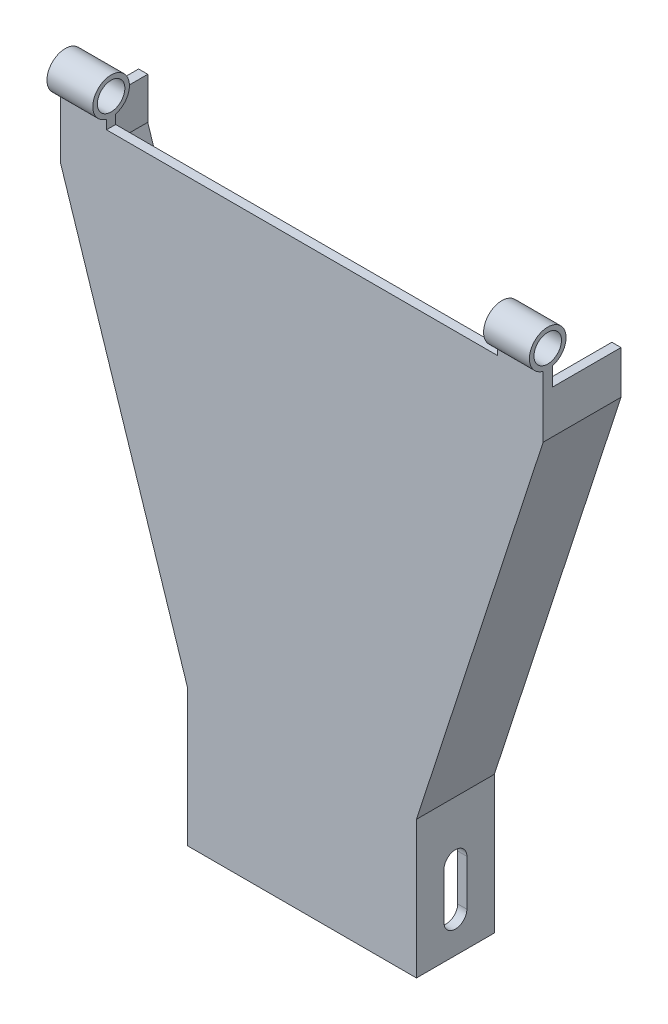
ISO-10303-21;
HEADER;
FILE_DESCRIPTION(('STEP AP214'),'2;1');
FILE_NAME('part.step','',(''),(''),'','','');
FILE_SCHEMA(('AUTOMOTIVE_DESIGN { 1 0 10303 214 1 1 1 1 }'));
ENDSEC;
DATA;
#1=APPLICATION_CONTEXT('core data for automotive mechanical design processes');
#2=APPLICATION_PROTOCOL_DEFINITION('international standard','automotive_design',2000,#1);
#3=PRODUCT_CONTEXT('',#1,'mechanical');
#4=PRODUCT('Part','Part','',(#3));
#5=PRODUCT_RELATED_PRODUCT_CATEGORY('part','',(#4));
#6=PRODUCT_DEFINITION_FORMATION('','',#4);
#7=PRODUCT_DEFINITION_CONTEXT('part definition',#1,'design');
#8=PRODUCT_DEFINITION('design','',#6,#7);
#9=PRODUCT_DEFINITION_SHAPE('','',#8);
#10=(LENGTH_UNIT() NAMED_UNIT(*) SI_UNIT(.MILLI.,.METRE.));
#11=(NAMED_UNIT(*) PLANE_ANGLE_UNIT() SI_UNIT($,.RADIAN.));
#12=(NAMED_UNIT(*) SI_UNIT($,.STERADIAN.) SOLID_ANGLE_UNIT());
#13=UNCERTAINTY_MEASURE_WITH_UNIT(LENGTH_MEASURE(1.E-05),#10,'distance_accuracy_value','');
#14=(GEOMETRIC_REPRESENTATION_CONTEXT(3) GLOBAL_UNCERTAINTY_ASSIGNED_CONTEXT((#13)) GLOBAL_UNIT_ASSIGNED_CONTEXT((#10,
#11,#12)) REPRESENTATION_CONTEXT('',''));
#15=CARTESIAN_POINT('',(0.,0.,0.));
#16=DIRECTION('',(0.,0.,1.));
#17=DIRECTION('',(1.,0.,0.));
#18=AXIS2_PLACEMENT_3D('',#15,#16,#17);
#19=CARTESIAN_POINT('',(-25.,-115.5,5.));
#20=DIRECTION('',(1.,0.,0.));
#21=DIRECTION('',(0.,1.,0.));
#22=AXIS2_PLACEMENT_3D('',#19,#20,#21);
#23=PLANE('',#22);
#24=DIRECTION('',(0.,0.,-1.));
#25=VECTOR('',#24,1.);
#26=CARTESIAN_POINT('',(-25.,-115.5,5.));
#27=LINE('',#26,#25);
#28=CARTESIAN_POINT('',(-25.,-115.5,5.));
#29=VERTEX_POINT('',#28);
#30=CARTESIAN_POINT('',(-25.,-115.5,-12.));
#31=VERTEX_POINT('',#30);
#32=EDGE_CURVE('E451',#29,#31,#27,.T.);
#33=ORIENTED_EDGE('',*,*,#32,.T.);
#34=DIRECTION('',(0.,-1.,0.));
#35=VECTOR('',#34,1.);
#36=CARTESIAN_POINT('',(-25.,-145.5,-12.));
#37=LINE('',#36,#35);
#38=CARTESIAN_POINT('',(-25.,-145.5,-12.));
#39=VERTEX_POINT('',#38);
#40=EDGE_CURVE('E261',#31,#39,#37,.T.);
#41=ORIENTED_EDGE('',*,*,#40,.T.);
#42=DIRECTION('',(0.,0.,-1.));
#43=VECTOR('',#42,1.);
#44=CARTESIAN_POINT('',(-25.,-145.5,5.));
#45=LINE('',#44,#43);
#46=CARTESIAN_POINT('',(-25.,-145.5,5.));
#47=VERTEX_POINT('',#46);
#48=EDGE_CURVE('E449',#47,#39,#45,.T.);
#49=ORIENTED_EDGE('',*,*,#48,.F.);
#50=DIRECTION('',(0.,-1.,0.));
#51=VECTOR('',#50,1.);
#52=CARTESIAN_POINT('',(-25.,-115.5,5.));
#53=LINE('',#52,#51);
#54=EDGE_CURVE('E401',#29,#47,#53,.T.);
#55=ORIENTED_EDGE('',*,*,#54,.F.);
#56=EDGE_LOOP('',(#33,#41,#49,#55));
#57=FACE_BOUND('',#56,.T.);
#58=CARTESIAN_POINT('',(-25.,-128.,-3.5));
#59=DIRECTION('',(1.,0.,0.));
#60=DIRECTION('',(0.,1.,0.));
#61=AXIS2_PLACEMENT_3D('',#58,#59,#60);
#62=CIRCLE('',#61,2.5);
#63=CARTESIAN_POINT('',(-25.,-128.,-6.));
#64=VERTEX_POINT('',#63);
#65=CARTESIAN_POINT('',(-25.,-128.,-1.));
#66=VERTEX_POINT('',#65);
#67=EDGE_CURVE('E52',#64,#66,#62,.T.);
#68=ORIENTED_EDGE('',*,*,#67,.T.);
#69=DIRECTION('',(0.,-1.,0.));
#70=VECTOR('',#69,1.);
#71=CARTESIAN_POINT('',(-25.,-128.,-1.));
#72=LINE('',#71,#70);
#73=CARTESIAN_POINT('',(-25.,-138.,-1.));
#74=VERTEX_POINT('',#73);
#75=EDGE_CURVE('E251',#66,#74,#72,.T.);
#76=ORIENTED_EDGE('',*,*,#75,.T.);
#77=CARTESIAN_POINT('',(-25.,-138.,-3.5));
#78=DIRECTION('',(1.,0.,0.));
#79=DIRECTION('',(0.,1.,0.));
#80=AXIS2_PLACEMENT_3D('',#77,#78,#79);
#81=CIRCLE('',#80,2.5);
#82=CARTESIAN_POINT('',(-25.,-138.,-6.));
#83=VERTEX_POINT('',#82);
#84=EDGE_CURVE('E237',#74,#83,#81,.T.);
#85=ORIENTED_EDGE('',*,*,#84,.T.);
#86=DIRECTION('',(0.,1.,0.));
#87=VECTOR('',#86,1.);
#88=CARTESIAN_POINT('',(-25.,-128.,-6.));
#89=LINE('',#88,#87);
#90=EDGE_CURVE('E246',#83,#64,#89,.T.);
#91=ORIENTED_EDGE('',*,*,#90,.T.);
#92=EDGE_LOOP('',(#68,#76,#85,#91));
#93=FACE_BOUND('',#92,.T.);
#94=ADVANCED_FACE('F37',(#57,#93),#23,.F.);
#95=CARTESIAN_POINT('',(-23.,-115.183238377329,-12.));
#96=DIRECTION('',(1.,0.,0.));
#97=DIRECTION('',(0.,1.,0.));
#98=AXIS2_PLACEMENT_3D('',#95,#96,#97);
#99=PLANE('',#98);
#100=DIRECTION('',(0.,1.,0.));
#101=VECTOR('',#100,1.);
#102=CARTESIAN_POINT('',(-23.,-115.183238377329,3.));
#103=LINE('',#102,#101);
#104=CARTESIAN_POINT('',(-23.,-145.5,3.));
#105=VERTEX_POINT('',#104);
#106=CARTESIAN_POINT('',(-23.,-115.183238377329,3.));
#107=VERTEX_POINT('',#106);
#108=EDGE_CURVE('E265',#105,#107,#103,.T.);
#109=ORIENTED_EDGE('',*,*,#108,.F.);
#110=DIRECTION('',(0.,0.,1.));
#111=VECTOR('',#110,1.);
#112=CARTESIAN_POINT('',(-23.,-145.5,-12.));
#113=LINE('',#112,#111);
#114=CARTESIAN_POINT('',(-23.,-145.5,-12.));
#115=VERTEX_POINT('',#114);
#116=EDGE_CURVE('E286',#115,#105,#113,.T.);
#117=ORIENTED_EDGE('',*,*,#116,.F.);
#118=DIRECTION('',(0.,1.,0.));
#119=VECTOR('',#118,1.);
#120=CARTESIAN_POINT('',(-23.,-115.183238377329,-12.));
#121=LINE('',#120,#119);
#122=CARTESIAN_POINT('',(-23.,-115.183238377329,-12.));
#123=VERTEX_POINT('',#122);
#124=EDGE_CURVE('E280',#115,#123,#121,.T.);
#125=ORIENTED_EDGE('',*,*,#124,.T.);
#126=DIRECTION('',(0.,0.,1.));
#127=VECTOR('',#126,1.);
#128=CARTESIAN_POINT('',(-23.,-115.183238377329,-12.));
#129=LINE('',#128,#127);
#130=EDGE_CURVE('E299',#123,#107,#129,.T.);
#131=ORIENTED_EDGE('',*,*,#130,.T.);
#132=EDGE_LOOP('',(#109,#117,#125,#131));
#133=FACE_BOUND('',#132,.T.);
#134=DIRECTION('',(0.,1.,0.));
#135=VECTOR('',#134,1.);
#136=CARTESIAN_POINT('',(-23.,-115.183238377329,-0.999999999999999));
#137=LINE('',#136,#135);
#138=CARTESIAN_POINT('',(-23.,-138.,-1.));
#139=VERTEX_POINT('',#138);
#140=CARTESIAN_POINT('',(-23.,-128.,-1.));
#141=VERTEX_POINT('',#140);
#142=EDGE_CURVE('E45',#139,#141,#137,.T.);
#143=ORIENTED_EDGE('',*,*,#142,.T.);
#144=CARTESIAN_POINT('',(-23.,-128.,-3.5));
#145=DIRECTION('',(1.,0.,0.));
#146=DIRECTION('',(0.,1.,0.));
#147=AXIS2_PLACEMENT_3D('',#144,#145,#146);
#148=CIRCLE('',#147,2.5);
#149=CARTESIAN_POINT('',(-23.,-128.,-6.));
#150=VERTEX_POINT('',#149);
#151=EDGE_CURVE('E11',#141,#150,#148,.F.);
#152=ORIENTED_EDGE('',*,*,#151,.T.);
#153=DIRECTION('',(0.,-1.,0.));
#154=VECTOR('',#153,1.);
#155=CARTESIAN_POINT('',(-23.,-115.183238377329,-6.));
#156=LINE('',#155,#154);
#157=CARTESIAN_POINT('',(-23.,-138.,-6.));
#158=VERTEX_POINT('',#157);
#159=EDGE_CURVE('E467',#150,#158,#156,.T.);
#160=ORIENTED_EDGE('',*,*,#159,.T.);
#161=CARTESIAN_POINT('',(-23.,-138.,-3.5));
#162=DIRECTION('',(1.,0.,0.));
#163=DIRECTION('',(0.,1.,0.));
#164=AXIS2_PLACEMENT_3D('',#161,#162,#163);
#165=CIRCLE('',#164,2.5);
#166=EDGE_CURVE('E240',#158,#139,#165,.F.);
#167=ORIENTED_EDGE('',*,*,#166,.T.);
#168=EDGE_LOOP('',(#143,#152,#160,#167));
#169=FACE_BOUND('',#168,.T.);
#170=ADVANCED_FACE('F471',(#133,#169),#99,.T.);
#171=CARTESIAN_POINT('',(0.,0.,3.));
#172=DIRECTION('',(0.,0.,-1.));
#173=DIRECTION('',(-1.,0.,0.));
#174=AXIS2_PLACEMENT_3D('',#171,#172,#173);
#175=PLANE('',#174);
#176=DIRECTION('',(-1.,0.,0.));
#177=VECTOR('',#176,1.);
#178=CARTESIAN_POINT('',(-52.65,-21.,3.));
#179=LINE('',#178,#177);
#180=CARTESIAN_POINT('',(-50.65,-21.,3.));
#181=VERTEX_POINT('',#180);
#182=CARTESIAN_POINT('',(-52.65,-21.,3.));
#183=VERTEX_POINT('',#182);
#184=EDGE_CURVE('E258',#181,#183,#179,.T.);
#185=ORIENTED_EDGE('',*,*,#184,.T.);
#186=DIRECTION('',(0.,-1.,0.));
#187=VECTOR('',#186,1.);
#188=CARTESIAN_POINT('',(-52.65,-30.4,3.));
#189=LINE('',#188,#187);
#190=CARTESIAN_POINT('',(-52.65,-17.,3.));
#191=VERTEX_POINT('',#190);
#192=EDGE_CURVE('E422',#191,#183,#189,.T.);
#193=ORIENTED_EDGE('',*,*,#192,.F.);
#194=DIRECTION('',(-1.,0.,0.));
#195=VECTOR('',#194,1.);
#196=CARTESIAN_POINT('',(-52.65,-17.,3.));
#197=LINE('',#196,#195);
#198=CARTESIAN_POINT('',(-42.65,-17.,3.));
#199=VERTEX_POINT('',#198);
#200=EDGE_CURVE('E390',#199,#191,#197,.T.);
#201=ORIENTED_EDGE('',*,*,#200,.F.);
#202=DIRECTION('',(0.,1.,0.));
#203=VECTOR('',#202,1.);
#204=CARTESIAN_POINT('',(-42.65,-17.,3.));
#205=LINE('',#204,#203);
#206=CARTESIAN_POINT('',(-42.65,-19.,3.));
#207=VERTEX_POINT('',#206);
#208=EDGE_CURVE('E397',#207,#199,#205,.T.);
#209=ORIENTED_EDGE('',*,*,#208,.F.);
#210=DIRECTION('',(-1.,0.,0.));
#211=VECTOR('',#210,1.);
#212=CARTESIAN_POINT('',(-42.65,-19.,3.));
#213=LINE('',#212,#211);
#214=CARTESIAN_POINT('',(42.65,-19.,3.));
#215=VERTEX_POINT('',#214);
#216=EDGE_CURVE('E434',#215,#207,#213,.T.);
#217=ORIENTED_EDGE('',*,*,#216,.F.);
#218=DIRECTION('',(0.,-1.,0.));
#219=VECTOR('',#218,1.);
#220=CARTESIAN_POINT('',(42.65,-19.,3.));
#221=LINE('',#220,#219);
#222=CARTESIAN_POINT('',(42.65,-17.,3.));
#223=VERTEX_POINT('',#222);
#224=EDGE_CURVE('E432',#223,#215,#221,.T.);
#225=ORIENTED_EDGE('',*,*,#224,.F.);
#226=DIRECTION('',(-1.,0.,0.));
#227=VECTOR('',#226,1.);
#228=CARTESIAN_POINT('',(42.65,-17.,3.));
#229=LINE('',#228,#227);
#230=CARTESIAN_POINT('',(52.65,-17.,3.));
#231=VERTEX_POINT('',#230);
#232=EDGE_CURVE('E429',#231,#223,#229,.T.);
#233=ORIENTED_EDGE('',*,*,#232,.F.);
#234=DIRECTION('',(0.,1.,0.));
#235=VECTOR('',#234,1.);
#236=CARTESIAN_POINT('',(52.65,-17.,3.));
#237=LINE('',#236,#235);
#238=CARTESIAN_POINT('',(52.65,-21.,3.));
#239=VERTEX_POINT('',#238);
#240=EDGE_CURVE('E427',#239,#231,#237,.T.);
#241=ORIENTED_EDGE('',*,*,#240,.F.);
#242=DIRECTION('',(1.,0.,0.));
#243=VECTOR('',#242,1.);
#244=CARTESIAN_POINT('',(52.65,-21.,3.));
#245=LINE('',#244,#243);
#246=CARTESIAN_POINT('',(50.65,-21.,3.));
#247=VERTEX_POINT('',#246);
#248=EDGE_CURVE('E343',#247,#239,#245,.T.);
#249=ORIENTED_EDGE('',*,*,#248,.F.);
#250=DIRECTION('',(0.,1.,0.));
#251=VECTOR('',#250,1.);
#252=CARTESIAN_POINT('',(50.65,-30.0832383773289,3.));
#253=LINE('',#252,#251);
#254=CARTESIAN_POINT('',(50.65,-30.0832383773289,3.));
#255=VERTEX_POINT('',#254);
#256=EDGE_CURVE('E363',#255,#247,#253,.T.);
#257=ORIENTED_EDGE('',*,*,#256,.F.);
#258=DIRECTION('',(0.309010260538414,0.951058704224919,0.));
#259=VECTOR('',#258,1.);
#260=CARTESIAN_POINT('',(50.65,-30.0832383773289,3.));
#261=LINE('',#260,#259);
#262=CARTESIAN_POINT('',(23.,-115.183238377329,3.));
#263=VERTEX_POINT('',#262);
#264=EDGE_CURVE('E361',#263,#255,#261,.T.);
#265=ORIENTED_EDGE('',*,*,#264,.F.);
#266=DIRECTION('',(0.,1.,0.));
#267=VECTOR('',#266,1.);
#268=CARTESIAN_POINT('',(23.,-115.183238377329,3.));
#269=LINE('',#268,#267);
#270=CARTESIAN_POINT('',(23.,-145.5,3.));
#271=VERTEX_POINT('',#270);
#272=EDGE_CURVE('E332',#271,#263,#269,.T.);
#273=ORIENTED_EDGE('',*,*,#272,.F.);
#274=DIRECTION('',(1.,0.,0.));
#275=VECTOR('',#274,1.);
#276=CARTESIAN_POINT('',(25.,-145.5,3.));
#277=LINE('',#276,#275);
#278=EDGE_CURVE('E425',#105,#271,#277,.T.);
#279=ORIENTED_EDGE('',*,*,#278,.F.);
#280=ORIENTED_EDGE('',*,*,#108,.T.);
#281=DIRECTION('',(-0.309010260538414,0.951058704224919,0.));
#282=VECTOR('',#281,1.);
#283=CARTESIAN_POINT('',(-50.65,-30.0832383773289,3.));
#284=LINE('',#283,#282);
#285=CARTESIAN_POINT('',(-50.65,-30.0832383773289,3.));
#286=VERTEX_POINT('',#285);
#287=EDGE_CURVE('E292',#107,#286,#284,.T.);
#288=ORIENTED_EDGE('',*,*,#287,.T.);
#289=DIRECTION('',(0.,1.,0.));
#290=VECTOR('',#289,1.);
#291=CARTESIAN_POINT('',(-50.65,-30.0832383773289,3.));
#292=LINE('',#291,#290);
#293=EDGE_CURVE('E289',#286,#181,#292,.T.);
#294=ORIENTED_EDGE('',*,*,#293,.T.);
#295=EDGE_LOOP('',(#185,#193,#201,#209,#217,#225,#233,#241,#249,#257,#265,#273,#279,#280,#288,#294));
#296=FACE_BOUND('',#295,.T.);
#297=ADVANCED_FACE('F494',(#296),#175,.T.);
#298=CARTESIAN_POINT('',(-52.65,-30.4,5.));
#299=DIRECTION('',(1.,0.,0.));
#300=DIRECTION('',(0.,0.,-1.));
#301=AXIS2_PLACEMENT_3D('',#298,#299,#300);
#302=PLANE('',#301);
#303=DIRECTION('',(0.,-1.,0.));
#304=VECTOR('',#303,1.);
#305=CARTESIAN_POINT('',(-52.65,-30.4,5.));
#306=LINE('',#305,#304);
#307=CARTESIAN_POINT('',(-52.65,-17.,5.));
#308=VERTEX_POINT('',#307);
#309=CARTESIAN_POINT('',(-52.65,-30.4,5.));
#310=VERTEX_POINT('',#309);
#311=EDGE_CURVE('E396',#308,#310,#306,.T.);
#312=ORIENTED_EDGE('',*,*,#311,.F.);
#313=CARTESIAN_POINT('',(-52.65,-13.1270166537926,4.));
#314=DIRECTION('',(1.,0.,0.));
#315=DIRECTION('',(0.,0.,-1.));
#316=AXIS2_PLACEMENT_3D('',#313,#314,#315);
#317=CIRCLE('',#316,4.);
#318=EDGE_CURVE('E311',#191,#308,#317,.T.);
#319=ORIENTED_EDGE('',*,*,#318,.F.);
#320=ORIENTED_EDGE('',*,*,#192,.T.);
#321=DIRECTION('',(0.,0.,1.));
#322=VECTOR('',#321,1.);
#323=CARTESIAN_POINT('',(-52.65,-21.,-12.));
#324=LINE('',#323,#322);
#325=CARTESIAN_POINT('',(-52.65,-21.,-12.));
#326=VERTEX_POINT('',#325);
#327=EDGE_CURVE('E305',#326,#183,#324,.T.);
#328=ORIENTED_EDGE('',*,*,#327,.F.);
#329=DIRECTION('',(0.,-1.,0.));
#330=VECTOR('',#329,1.);
#331=CARTESIAN_POINT('',(-52.65,-30.4,-12.));
#332=LINE('',#331,#330);
#333=CARTESIAN_POINT('',(-52.65,-30.4,-12.));
#334=VERTEX_POINT('',#333);
#335=EDGE_CURVE('E268',#326,#334,#332,.T.);
#336=ORIENTED_EDGE('',*,*,#335,.T.);
#337=DIRECTION('',(0.,0.,-1.));
#338=VECTOR('',#337,1.);
#339=CARTESIAN_POINT('',(-52.65,-30.4,5.));
#340=LINE('',#339,#338);
#341=EDGE_CURVE('E453',#310,#334,#340,.T.);
#342=ORIENTED_EDGE('',*,*,#341,.F.);
#343=EDGE_LOOP('',(#312,#319,#320,#328,#336,#342));
#344=FACE_BOUND('',#343,.T.);
#345=CARTESIAN_POINT('',(-52.65,-13.1270166537926,4.));
#346=DIRECTION('',(1.,0.,0.));
#347=DIRECTION('',(0.,0.,-1.));
#348=AXIS2_PLACEMENT_3D('',#345,#346,#347);
#349=CIRCLE('',#348,3.);
#350=CARTESIAN_POINT('',(-52.65,-13.1270166537926,0.999999999999999));
#351=VERTEX_POINT('',#350);
#352=EDGE_CURVE('E307',#351,#351,#349,.T.);
#353=ORIENTED_EDGE('',*,*,#352,.T.);
#354=EDGE_LOOP('',(#353));
#355=FACE_BOUND('',#354,.T.);
#356=ADVANCED_FACE('F39',(#344,#355),#302,.F.);
#357=CARTESIAN_POINT('',(-52.65,-30.4,5.));
#358=DIRECTION('',(0.951058704224919,0.309010260538414,0.));
#359=DIRECTION('',(-0.309010260538414,0.951058704224919,0.));
#360=AXIS2_PLACEMENT_3D('',#357,#358,#359);
#361=PLANE('',#360);
#362=ORIENTED_EDGE('',*,*,#341,.T.);
#363=DIRECTION('',(0.309010260538414,-0.951058704224919,0.));
#364=VECTOR('',#363,1.);
#365=CARTESIAN_POINT('',(-25.,-115.5,-12.));
#366=LINE('',#365,#364);
#367=EDGE_CURVE('E264',#334,#31,#366,.T.);
#368=ORIENTED_EDGE('',*,*,#367,.T.);
#369=ORIENTED_EDGE('',*,*,#32,.F.);
#370=DIRECTION('',(0.309010260538414,-0.951058704224919,0.));
#371=VECTOR('',#370,1.);
#372=CARTESIAN_POINT('',(-52.65,-30.4,5.));
#373=LINE('',#372,#371);
#374=EDGE_CURVE('E399',#310,#29,#373,.T.);
#375=ORIENTED_EDGE('',*,*,#374,.F.);
#376=EDGE_LOOP('',(#362,#368,#369,#375));
#377=FACE_BOUND('',#376,.T.);
#378=ADVANCED_FACE('F500',(#377),#361,.F.);
#379=CARTESIAN_POINT('',(25.,-145.5,5.));
#380=DIRECTION('',(0.,1.,0.));
#381=DIRECTION('',(0.,0.,1.));
#382=AXIS2_PLACEMENT_3D('',#379,#380,#381);
#383=PLANE('',#382);
#384=ORIENTED_EDGE('',*,*,#48,.T.);
#385=DIRECTION('',(1.,0.,0.));
#386=VECTOR('',#385,1.);
#387=CARTESIAN_POINT('',(-23.,-145.5,-12.));
#388=LINE('',#387,#386);
#389=EDGE_CURVE('E283',#39,#115,#388,.T.);
#390=ORIENTED_EDGE('',*,*,#389,.T.);
#391=ORIENTED_EDGE('',*,*,#116,.T.);
#392=ORIENTED_EDGE('',*,*,#278,.T.);
#393=DIRECTION('',(0.,0.,1.));
#394=VECTOR('',#393,1.);
#395=CARTESIAN_POINT('',(23.,-145.5,-12.));
#396=LINE('',#395,#394);
#397=CARTESIAN_POINT('',(23.,-145.5,-12.));
#398=VERTEX_POINT('',#397);
#399=EDGE_CURVE('E377',#398,#271,#396,.T.);
#400=ORIENTED_EDGE('',*,*,#399,.F.);
#401=DIRECTION('',(-1.,0.,0.));
#402=VECTOR('',#401,1.);
#403=CARTESIAN_POINT('',(23.,-145.5,-12.));
#404=LINE('',#403,#402);
#405=CARTESIAN_POINT('',(25.,-145.5,-12.));
#406=VERTEX_POINT('',#405);
#407=EDGE_CURVE('E342',#406,#398,#404,.T.);
#408=ORIENTED_EDGE('',*,*,#407,.F.);
#409=DIRECTION('',(0.,0.,-1.));
#410=VECTOR('',#409,1.);
#411=CARTESIAN_POINT('',(25.,-145.5,5.));
#412=LINE('',#411,#410);
#413=CARTESIAN_POINT('',(25.,-145.5,5.));
#414=VERTEX_POINT('',#413);
#415=EDGE_CURVE('E447',#414,#406,#412,.T.);
#416=ORIENTED_EDGE('',*,*,#415,.F.);
#417=DIRECTION('',(1.,0.,0.));
#418=VECTOR('',#417,1.);
#419=CARTESIAN_POINT('',(25.,-145.5,5.));
#420=LINE('',#419,#418);
#421=EDGE_CURVE('E403',#47,#414,#420,.T.);
#422=ORIENTED_EDGE('',*,*,#421,.F.);
#423=EDGE_LOOP('',(#384,#390,#391,#392,#400,#408,#416,#422));
#424=FACE_BOUND('',#423,.T.);
#425=ADVANCED_FACE('F498',(#424),#383,.F.);
#426=CARTESIAN_POINT('',(25.,-115.5,5.));
#427=DIRECTION('',(-1.,0.,0.));
#428=DIRECTION('',(0.,-1.,0.));
#429=AXIS2_PLACEMENT_3D('',#426,#427,#428);
#430=PLANE('',#429);
#431=DIRECTION('',(0.,-1.,0.));
#432=VECTOR('',#431,1.);
#433=CARTESIAN_POINT('',(25.,-128.,-1.));
#434=LINE('',#433,#432);
#435=CARTESIAN_POINT('',(25.,-128.,-1.));
#436=VERTEX_POINT('',#435);
#437=CARTESIAN_POINT('',(25.,-138.,-1.));
#438=VERTEX_POINT('',#437);
#439=EDGE_CURVE('E320',#436,#438,#434,.T.);
#440=ORIENTED_EDGE('',*,*,#439,.F.);
#441=CARTESIAN_POINT('',(25.,-128.,-3.5));
#442=DIRECTION('',(1.,0.,0.));
#443=DIRECTION('',(0.,1.,0.));
#444=AXIS2_PLACEMENT_3D('',#441,#442,#443);
#445=CIRCLE('',#444,2.5);
#446=CARTESIAN_POINT('',(25.,-128.,-6.));
#447=VERTEX_POINT('',#446);
#448=EDGE_CURVE('E317',#447,#436,#445,.T.);
#449=ORIENTED_EDGE('',*,*,#448,.F.);
#450=DIRECTION('',(0.,1.,0.));
#451=VECTOR('',#450,1.);
#452=CARTESIAN_POINT('',(25.,-128.,-6.));
#453=LINE('',#452,#451);
#454=CARTESIAN_POINT('',(25.,-138.,-6.));
#455=VERTEX_POINT('',#454);
#456=EDGE_CURVE('E326',#455,#447,#453,.T.);
#457=ORIENTED_EDGE('',*,*,#456,.F.);
#458=CARTESIAN_POINT('',(25.,-138.,-3.5));
#459=DIRECTION('',(1.,0.,0.));
#460=DIRECTION('',(0.,1.,0.));
#461=AXIS2_PLACEMENT_3D('',#458,#459,#460);
#462=CIRCLE('',#461,2.5);
#463=EDGE_CURVE('E323',#438,#455,#462,.T.);
#464=ORIENTED_EDGE('',*,*,#463,.F.);
#465=EDGE_LOOP('',(#440,#449,#457,#464));
#466=FACE_BOUND('',#465,.T.);
#467=ORIENTED_EDGE('',*,*,#415,.T.);
#468=DIRECTION('',(0.,-1.,0.));
#469=VECTOR('',#468,1.);
#470=CARTESIAN_POINT('',(25.,-145.5,-12.));
#471=LINE('',#470,#469);
#472=CARTESIAN_POINT('',(25.,-115.5,-12.));
#473=VERTEX_POINT('',#472);
#474=EDGE_CURVE('E339',#473,#406,#471,.T.);
#475=ORIENTED_EDGE('',*,*,#474,.F.);
#476=DIRECTION('',(0.,0.,-1.));
#477=VECTOR('',#476,1.);
#478=CARTESIAN_POINT('',(25.,-115.5,5.));
#479=LINE('',#478,#477);
#480=CARTESIAN_POINT('',(25.,-115.5,5.));
#481=VERTEX_POINT('',#480);
#482=EDGE_CURVE('E445',#481,#473,#479,.T.);
#483=ORIENTED_EDGE('',*,*,#482,.F.);
#484=DIRECTION('',(0.,1.,0.));
#485=VECTOR('',#484,1.);
#486=CARTESIAN_POINT('',(25.,-115.5,5.));
#487=LINE('',#486,#485);
#488=EDGE_CURVE('E405',#414,#481,#487,.T.);
#489=ORIENTED_EDGE('',*,*,#488,.F.);
#490=EDGE_LOOP('',(#467,#475,#483,#489));
#491=FACE_BOUND('',#490,.T.);
#492=ADVANCED_FACE('F507',(#466,#491),#430,.F.);
#493=CARTESIAN_POINT('',(52.65,-30.4,5.));
#494=DIRECTION('',(-0.951058704224919,0.309010260538414,0.));
#495=DIRECTION('',(-0.309010260538414,-0.951058704224919,0.));
#496=AXIS2_PLACEMENT_3D('',#493,#494,#495);
#497=PLANE('',#496);
#498=ORIENTED_EDGE('',*,*,#482,.T.);
#499=DIRECTION('',(-0.309010260538414,-0.951058704224919,0.));
#500=VECTOR('',#499,1.);
#501=CARTESIAN_POINT('',(25.,-115.5,-12.));
#502=LINE('',#501,#500);
#503=CARTESIAN_POINT('',(52.65,-30.4,-12.));
#504=VERTEX_POINT('',#503);
#505=EDGE_CURVE('E356',#504,#473,#502,.T.);
#506=ORIENTED_EDGE('',*,*,#505,.F.);
#507=DIRECTION('',(0.,0.,-1.));
#508=VECTOR('',#507,1.);
#509=CARTESIAN_POINT('',(52.65,-30.4,5.));
#510=LINE('',#509,#508);
#511=CARTESIAN_POINT('',(52.65,-30.4,5.));
#512=VERTEX_POINT('',#511);
#513=EDGE_CURVE('E443',#512,#504,#510,.T.);
#514=ORIENTED_EDGE('',*,*,#513,.F.);
#515=DIRECTION('',(0.309010260538414,0.951058704224919,0.));
#516=VECTOR('',#515,1.);
#517=CARTESIAN_POINT('',(52.65,-30.4,5.));
#518=LINE('',#517,#516);
#519=EDGE_CURVE('E407',#481,#512,#518,.T.);
#520=ORIENTED_EDGE('',*,*,#519,.F.);
#521=EDGE_LOOP('',(#498,#506,#514,#520));
#522=FACE_BOUND('',#521,.T.);
#523=ADVANCED_FACE('F603',(#522),#497,.F.);
#524=CARTESIAN_POINT('',(52.65,-17.,5.));
#525=DIRECTION('',(-1.,0.,0.));
#526=DIRECTION('',(0.,0.,1.));
#527=AXIS2_PLACEMENT_3D('',#524,#525,#526);
#528=PLANE('',#527);
#529=ORIENTED_EDGE('',*,*,#513,.T.);
#530=DIRECTION('',(0.,-1.,0.));
#531=VECTOR('',#530,1.);
#532=CARTESIAN_POINT('',(52.65,-30.4,-12.));
#533=LINE('',#532,#531);
#534=CARTESIAN_POINT('',(52.65,-21.,-12.));
#535=VERTEX_POINT('',#534);
#536=EDGE_CURVE('E353',#535,#504,#533,.T.);
#537=ORIENTED_EDGE('',*,*,#536,.F.);
#538=DIRECTION('',(0.,0.,1.));
#539=VECTOR('',#538,1.);
#540=CARTESIAN_POINT('',(52.65,-21.,-12.));
#541=LINE('',#540,#539);
#542=EDGE_CURVE('E359',#535,#239,#541,.T.);
#543=ORIENTED_EDGE('',*,*,#542,.T.);
#544=ORIENTED_EDGE('',*,*,#240,.T.);
#545=CARTESIAN_POINT('',(52.65,-13.1270166537926,4.));
#546=DIRECTION('',(1.,0.,0.));
#547=DIRECTION('',(0.,0.,-1.));
#548=AXIS2_PLACEMENT_3D('',#545,#546,#547);
#549=CIRCLE('',#548,4.);
#550=CARTESIAN_POINT('',(52.65,-17.,5.));
#551=VERTEX_POINT('',#550);
#552=EDGE_CURVE('E384',#231,#551,#549,.T.);
#553=ORIENTED_EDGE('',*,*,#552,.T.);
#554=DIRECTION('',(0.,1.,0.));
#555=VECTOR('',#554,1.);
#556=CARTESIAN_POINT('',(52.65,-17.,5.));
#557=LINE('',#556,#555);
#558=EDGE_CURVE('E409',#512,#551,#557,.T.);
#559=ORIENTED_EDGE('',*,*,#558,.F.);
#560=EDGE_LOOP('',(#529,#537,#543,#544,#553,#559));
#561=FACE_BOUND('',#560,.T.);
#562=CARTESIAN_POINT('',(52.65,-13.1270166537926,4.));
#563=DIRECTION('',(1.,0.,0.));
#564=DIRECTION('',(0.,0.,-1.));
#565=AXIS2_PLACEMENT_3D('',#562,#563,#564);
#566=CIRCLE('',#565,3.);
#567=CARTESIAN_POINT('',(52.65,-13.1270166537926,0.999999999999999));
#568=VERTEX_POINT('',#567);
#569=EDGE_CURVE('E380',#568,#568,#566,.T.);
#570=ORIENTED_EDGE('',*,*,#569,.F.);
#571=EDGE_LOOP('',(#570));
#572=FACE_BOUND('',#571,.T.);
#573=ADVANCED_FACE('F568',(#561,#572),#528,.F.);
#574=CARTESIAN_POINT('',(42.65,-19.,5.));
#575=DIRECTION('',(1.,0.,0.));
#576=DIRECTION('',(0.,0.,-1.));
#577=AXIS2_PLACEMENT_3D('',#574,#575,#576);
#578=PLANE('',#577);
#579=DIRECTION('',(0.,-1.,0.));
#580=VECTOR('',#579,1.);
#581=CARTESIAN_POINT('',(42.65,-19.,5.));
#582=LINE('',#581,#580);
#583=CARTESIAN_POINT('',(42.65,-17.,5.));
#584=VERTEX_POINT('',#583);
#585=CARTESIAN_POINT('',(42.65,-19.,5.));
#586=VERTEX_POINT('',#585);
#587=EDGE_CURVE('E413',#584,#586,#582,.T.);
#588=ORIENTED_EDGE('',*,*,#587,.F.);
#589=CARTESIAN_POINT('',(42.65,-13.1270166537926,4.));
#590=DIRECTION('',(1.,0.,0.));
#591=DIRECTION('',(0.,0.,-1.));
#592=AXIS2_PLACEMENT_3D('',#589,#590,#591);
#593=CIRCLE('',#592,4.);
#594=EDGE_CURVE('E387',#223,#584,#593,.T.);
#595=ORIENTED_EDGE('',*,*,#594,.F.);
#596=ORIENTED_EDGE('',*,*,#224,.T.);
#597=DIRECTION('',(0.,0.,-1.));
#598=VECTOR('',#597,1.);
#599=CARTESIAN_POINT('',(42.65,-19.,5.));
#600=LINE('',#599,#598);
#601=EDGE_CURVE('E440',#586,#215,#600,.T.);
#602=ORIENTED_EDGE('',*,*,#601,.F.);
#603=EDGE_LOOP('',(#588,#595,#596,#602));
#604=FACE_BOUND('',#603,.T.);
#605=CARTESIAN_POINT('',(42.65,-13.1270166537926,4.));
#606=DIRECTION('',(1.,0.,0.));
#607=DIRECTION('',(0.,0.,-1.));
#608=AXIS2_PLACEMENT_3D('',#605,#606,#607);
#609=CIRCLE('',#608,3.);
#610=CARTESIAN_POINT('',(42.65,-13.1270166537926,0.999999999999999));
#611=VERTEX_POINT('',#610);
#612=EDGE_CURVE('E381',#611,#611,#609,.T.);
#613=ORIENTED_EDGE('',*,*,#612,.T.);
#614=EDGE_LOOP('',(#613));
#615=FACE_BOUND('',#614,.T.);
#616=ADVANCED_FACE('F557',(#604,#615),#578,.F.);
#617=CARTESIAN_POINT('',(-42.65,-19.,5.));
#618=DIRECTION('',(0.,-1.,0.));
#619=DIRECTION('',(0.,0.,-1.));
#620=AXIS2_PLACEMENT_3D('',#617,#618,#619);
#621=PLANE('',#620);
#622=ORIENTED_EDGE('',*,*,#216,.T.);
#623=DIRECTION('',(0.,0.,-1.));
#624=VECTOR('',#623,1.);
#625=CARTESIAN_POINT('',(-42.65,-19.,5.));
#626=LINE('',#625,#624);
#627=CARTESIAN_POINT('',(-42.65,-19.,5.));
#628=VERTEX_POINT('',#627);
#629=EDGE_CURVE('E420',#628,#207,#626,.T.);
#630=ORIENTED_EDGE('',*,*,#629,.F.);
#631=DIRECTION('',(-1.,0.,0.));
#632=VECTOR('',#631,1.);
#633=CARTESIAN_POINT('',(-42.65,-19.,5.));
#634=LINE('',#633,#632);
#635=EDGE_CURVE('E415',#586,#628,#634,.T.);
#636=ORIENTED_EDGE('',*,*,#635,.F.);
#637=ORIENTED_EDGE('',*,*,#601,.T.);
#638=EDGE_LOOP('',(#622,#630,#636,#637));
#639=FACE_BOUND('',#638,.T.);
#640=ADVANCED_FACE('F553',(#639),#621,.F.);
#641=CARTESIAN_POINT('',(-42.65,-17.,5.));
#642=DIRECTION('',(-1.,0.,0.));
#643=DIRECTION('',(0.,0.,1.));
#644=AXIS2_PLACEMENT_3D('',#641,#642,#643);
#645=PLANE('',#644);
#646=ORIENTED_EDGE('',*,*,#208,.T.);
#647=CARTESIAN_POINT('',(-42.65,-13.1270166537926,4.));
#648=DIRECTION('',(1.,0.,0.));
#649=DIRECTION('',(0.,0.,-1.));
#650=AXIS2_PLACEMENT_3D('',#647,#648,#649);
#651=CIRCLE('',#650,4.);
#652=CARTESIAN_POINT('',(-42.65,-17.,5.));
#653=VERTEX_POINT('',#652);
#654=EDGE_CURVE('E314',#199,#653,#651,.T.);
#655=ORIENTED_EDGE('',*,*,#654,.T.);
#656=DIRECTION('',(0.,1.,0.));
#657=VECTOR('',#656,1.);
#658=CARTESIAN_POINT('',(-42.65,-17.,5.));
#659=LINE('',#658,#657);
#660=EDGE_CURVE('E417',#628,#653,#659,.T.);
#661=ORIENTED_EDGE('',*,*,#660,.F.);
#662=ORIENTED_EDGE('',*,*,#629,.T.);
#663=EDGE_LOOP('',(#646,#655,#661,#662));
#664=FACE_BOUND('',#663,.T.);
#665=CARTESIAN_POINT('',(-42.65,-13.1270166537926,4.));
#666=DIRECTION('',(1.,0.,0.));
#667=DIRECTION('',(0.,0.,-1.));
#668=AXIS2_PLACEMENT_3D('',#665,#666,#667);
#669=CIRCLE('',#668,3.);
#670=CARTESIAN_POINT('',(-42.65,-13.1270166537926,0.999999999999999));
#671=VERTEX_POINT('',#670);
#672=EDGE_CURVE('E308',#671,#671,#669,.T.);
#673=ORIENTED_EDGE('',*,*,#672,.F.);
#674=EDGE_LOOP('',(#673));
#675=FACE_BOUND('',#674,.T.);
#676=ADVANCED_FACE('F547',(#664,#675),#645,.F.);
#677=CARTESIAN_POINT('',(0.,0.,5.));
#678=DIRECTION('',(0.,0.,-1.));
#679=DIRECTION('',(-1.,0.,0.));
#680=AXIS2_PLACEMENT_3D('',#677,#678,#679);
#681=PLANE('',#680);
#682=DIRECTION('',(-1.,0.,0.));
#683=VECTOR('',#682,1.);
#684=CARTESIAN_POINT('',(-52.65,-17.,5.));
#685=LINE('',#684,#683);
#686=EDGE_CURVE('E393',#653,#308,#685,.T.);
#687=ORIENTED_EDGE('',*,*,#686,.T.);
#688=ORIENTED_EDGE('',*,*,#311,.T.);
#689=ORIENTED_EDGE('',*,*,#374,.T.);
#690=ORIENTED_EDGE('',*,*,#54,.T.);
#691=ORIENTED_EDGE('',*,*,#421,.T.);
#692=ORIENTED_EDGE('',*,*,#488,.T.);
#693=ORIENTED_EDGE('',*,*,#519,.T.);
#694=ORIENTED_EDGE('',*,*,#558,.T.);
#695=DIRECTION('',(-1.,0.,0.));
#696=VECTOR('',#695,1.);
#697=CARTESIAN_POINT('',(42.65,-17.,5.));
#698=LINE('',#697,#696);
#699=EDGE_CURVE('E411',#551,#584,#698,.T.);
#700=ORIENTED_EDGE('',*,*,#699,.T.);
#701=ORIENTED_EDGE('',*,*,#587,.T.);
#702=ORIENTED_EDGE('',*,*,#635,.T.);
#703=ORIENTED_EDGE('',*,*,#660,.T.);
#704=EDGE_LOOP('',(#687,#688,#689,#690,#691,#692,#693,#694,#700,#701,#702,#703));
#705=FACE_BOUND('',#704,.T.);
#706=ADVANCED_FACE('F541',(#705),#681,.F.);
#707=CARTESIAN_POINT('',(42.65,-13.1270166537926,4.));
#708=DIRECTION('',(1.,0.,0.));
#709=DIRECTION('',(0.,0.,-1.));
#710=AXIS2_PLACEMENT_3D('',#707,#708,#709);
#711=CYLINDRICAL_SURFACE('',#710,4.);
#712=ORIENTED_EDGE('',*,*,#699,.F.);
#713=ORIENTED_EDGE('',*,*,#552,.F.);
#714=ORIENTED_EDGE('',*,*,#232,.T.);
#715=ORIENTED_EDGE('',*,*,#594,.T.);
#716=EDGE_LOOP('',(#712,#713,#714,#715));
#717=FACE_BOUND('',#716,.T.);
#718=ADVANCED_FACE('F565',(#717),#711,.T.);
#719=CARTESIAN_POINT('',(42.65,-13.1270166537926,4.));
#720=DIRECTION('',(1.,0.,0.));
#721=DIRECTION('',(0.,0.,-1.));
#722=AXIS2_PLACEMENT_3D('',#719,#720,#721);
#723=CYLINDRICAL_SURFACE('',#722,3.);
#724=ORIENTED_EDGE('',*,*,#612,.F.);
#725=EDGE_LOOP('',(#724));
#726=FACE_BOUND('',#725,.T.);
#727=ORIENTED_EDGE('',*,*,#569,.T.);
#728=EDGE_LOOP('',(#727));
#729=FACE_BOUND('',#728,.T.);
#730=ADVANCED_FACE('F625',(#726,#729),#723,.F.);
#731=CARTESIAN_POINT('',(23.,-115.183238377329,-12.));
#732=DIRECTION('',(1.,0.,0.));
#733=DIRECTION('',(0.,1.,0.));
#734=AXIS2_PLACEMENT_3D('',#731,#732,#733);
#735=PLANE('',#734);
#736=DIRECTION('',(0.,1.,0.));
#737=VECTOR('',#736,1.);
#738=CARTESIAN_POINT('',(23.,-115.183238377329,-6.));
#739=LINE('',#738,#737);
#740=CARTESIAN_POINT('',(23.,-138.,-6.));
#741=VERTEX_POINT('',#740);
#742=CARTESIAN_POINT('',(23.,-128.,-6.));
#743=VERTEX_POINT('',#742);
#744=EDGE_CURVE('E461',#741,#743,#739,.T.);
#745=ORIENTED_EDGE('',*,*,#744,.T.);
#746=CARTESIAN_POINT('',(23.,-128.,-3.5));
#747=DIRECTION('',(1.,0.,0.));
#748=DIRECTION('',(0.,1.,0.));
#749=AXIS2_PLACEMENT_3D('',#746,#747,#748);
#750=CIRCLE('',#749,2.5);
#751=CARTESIAN_POINT('',(23.,-128.,-1.));
#752=VERTEX_POINT('',#751);
#753=EDGE_CURVE('E464',#743,#752,#750,.T.);
#754=ORIENTED_EDGE('',*,*,#753,.T.);
#755=DIRECTION('',(0.,-1.,0.));
#756=VECTOR('',#755,1.);
#757=CARTESIAN_POINT('',(23.,-115.183238377329,-0.999999999999999));
#758=LINE('',#757,#756);
#759=CARTESIAN_POINT('',(23.,-138.,-1.));
#760=VERTEX_POINT('',#759);
#761=EDGE_CURVE('E455',#752,#760,#758,.T.);
#762=ORIENTED_EDGE('',*,*,#761,.T.);
#763=CARTESIAN_POINT('',(23.,-138.,-3.5));
#764=DIRECTION('',(1.,0.,0.));
#765=DIRECTION('',(0.,1.,0.));
#766=AXIS2_PLACEMENT_3D('',#763,#764,#765);
#767=CIRCLE('',#766,2.5);
#768=EDGE_CURVE('E458',#760,#741,#767,.T.);
#769=ORIENTED_EDGE('',*,*,#768,.T.);
#770=EDGE_LOOP('',(#745,#754,#762,#769));
#771=FACE_BOUND('',#770,.T.);
#772=ORIENTED_EDGE('',*,*,#272,.T.);
#773=DIRECTION('',(0.,0.,1.));
#774=VECTOR('',#773,1.);
#775=CARTESIAN_POINT('',(23.,-115.183238377329,-12.));
#776=LINE('',#775,#774);
#777=CARTESIAN_POINT('',(23.,-115.183238377329,-12.));
#778=VERTEX_POINT('',#777);
#779=EDGE_CURVE('E374',#778,#263,#776,.T.);
#780=ORIENTED_EDGE('',*,*,#779,.F.);
#781=DIRECTION('',(0.,1.,0.));
#782=VECTOR('',#781,1.);
#783=CARTESIAN_POINT('',(23.,-115.183238377329,-12.));
#784=LINE('',#783,#782);
#785=EDGE_CURVE('E345',#398,#778,#784,.T.);
#786=ORIENTED_EDGE('',*,*,#785,.F.);
#787=ORIENTED_EDGE('',*,*,#399,.T.);
#788=EDGE_LOOP('',(#772,#780,#786,#787));
#789=FACE_BOUND('',#788,.T.);
#790=ADVANCED_FACE('F589',(#771,#789),#735,.F.);
#791=CARTESIAN_POINT('',(50.65,-30.0832383773289,-12.));
#792=DIRECTION('',(0.951058704224919,-0.309010260538414,0.));
#793=DIRECTION('',(0.309010260538414,0.951058704224919,0.));
#794=AXIS2_PLACEMENT_3D('',#791,#792,#793);
#795=PLANE('',#794);
#796=ORIENTED_EDGE('',*,*,#264,.T.);
#797=DIRECTION('',(0.,0.,1.));
#798=VECTOR('',#797,1.);
#799=CARTESIAN_POINT('',(50.65,-30.0832383773289,-12.));
#800=LINE('',#799,#798);
#801=CARTESIAN_POINT('',(50.65,-30.0832383773289,-12.));
#802=VERTEX_POINT('',#801);
#803=EDGE_CURVE('E371',#802,#255,#800,.T.);
#804=ORIENTED_EDGE('',*,*,#803,.F.);
#805=DIRECTION('',(0.309010260538414,0.951058704224919,0.));
#806=VECTOR('',#805,1.);
#807=CARTESIAN_POINT('',(50.65,-30.0832383773289,-12.));
#808=LINE('',#807,#806);
#809=EDGE_CURVE('E347',#778,#802,#808,.T.);
#810=ORIENTED_EDGE('',*,*,#809,.F.);
#811=ORIENTED_EDGE('',*,*,#779,.T.);
#812=EDGE_LOOP('',(#796,#804,#810,#811));
#813=FACE_BOUND('',#812,.T.);
#814=ADVANCED_FACE('F585',(#813),#795,.F.);
#815=CARTESIAN_POINT('',(50.65,-30.0832383773289,-12.));
#816=DIRECTION('',(1.,0.,0.));
#817=DIRECTION('',(0.,0.,-1.));
#818=AXIS2_PLACEMENT_3D('',#815,#816,#817);
#819=PLANE('',#818);
#820=ORIENTED_EDGE('',*,*,#256,.T.);
#821=DIRECTION('',(0.,0.,1.));
#822=VECTOR('',#821,1.);
#823=CARTESIAN_POINT('',(50.65,-21.,-12.));
#824=LINE('',#823,#822);
#825=CARTESIAN_POINT('',(50.65,-21.,-12.));
#826=VERTEX_POINT('',#825);
#827=EDGE_CURVE('E368',#826,#247,#824,.T.);
#828=ORIENTED_EDGE('',*,*,#827,.F.);
#829=DIRECTION('',(0.,1.,0.));
#830=VECTOR('',#829,1.);
#831=CARTESIAN_POINT('',(50.65,-30.0832383773289,-12.));
#832=LINE('',#831,#830);
#833=EDGE_CURVE('E349',#802,#826,#832,.T.);
#834=ORIENTED_EDGE('',*,*,#833,.F.);
#835=ORIENTED_EDGE('',*,*,#803,.T.);
#836=EDGE_LOOP('',(#820,#828,#834,#835));
#837=FACE_BOUND('',#836,.T.);
#838=ADVANCED_FACE('F581',(#837),#819,.F.);
#839=CARTESIAN_POINT('',(52.65,-21.,-12.));
#840=DIRECTION('',(0.,-1.,0.));
#841=DIRECTION('',(0.,0.,-1.));
#842=AXIS2_PLACEMENT_3D('',#839,#840,#841);
#843=PLANE('',#842);
#844=ORIENTED_EDGE('',*,*,#248,.T.);
#845=ORIENTED_EDGE('',*,*,#542,.F.);
#846=DIRECTION('',(1.,0.,0.));
#847=VECTOR('',#846,1.);
#848=CARTESIAN_POINT('',(52.65,-21.,-12.));
#849=LINE('',#848,#847);
#850=EDGE_CURVE('E351',#826,#535,#849,.T.);
#851=ORIENTED_EDGE('',*,*,#850,.F.);
#852=ORIENTED_EDGE('',*,*,#827,.T.);
#853=EDGE_LOOP('',(#844,#845,#851,#852));
#854=FACE_BOUND('',#853,.T.);
#855=ADVANCED_FACE('F576',(#854),#843,.F.);
#856=CARTESIAN_POINT('',(0.,0.,-12.));
#857=DIRECTION('',(0.,0.,1.));
#858=DIRECTION('',(1.,0.,0.));
#859=AXIS2_PLACEMENT_3D('',#856,#857,#858);
#860=PLANE('',#859);
#861=ORIENTED_EDGE('',*,*,#474,.T.);
#862=ORIENTED_EDGE('',*,*,#407,.T.);
#863=ORIENTED_EDGE('',*,*,#785,.T.);
#864=ORIENTED_EDGE('',*,*,#809,.T.);
#865=ORIENTED_EDGE('',*,*,#833,.T.);
#866=ORIENTED_EDGE('',*,*,#850,.T.);
#867=ORIENTED_EDGE('',*,*,#536,.T.);
#868=ORIENTED_EDGE('',*,*,#505,.T.);
#869=EDGE_LOOP('',(#861,#862,#863,#864,#865,#866,#867,#868));
#870=FACE_BOUND('',#869,.T.);
#871=ADVANCED_FACE('F596',(#870),#860,.F.);
#872=CARTESIAN_POINT('',(-52.65,-128.,-3.5));
#873=DIRECTION('',(1.,0.,0.));
#874=DIRECTION('',(0.,1.,0.));
#875=AXIS2_PLACEMENT_3D('',#872,#873,#874);
#876=CYLINDRICAL_SURFACE('',#875,2.5);
#877=DIRECTION('',(1.,0.,0.));
#878=VECTOR('',#877,1.);
#879=CARTESIAN_POINT('',(-52.65,-128.,-6.));
#880=LINE('',#879,#878);
#881=EDGE_CURVE('E330',#743,#447,#880,.T.);
#882=ORIENTED_EDGE('',*,*,#881,.T.);
#883=ORIENTED_EDGE('',*,*,#448,.T.);
#884=DIRECTION('',(1.,0.,0.));
#885=VECTOR('',#884,1.);
#886=CARTESIAN_POINT('',(-52.65,-128.,-1.));
#887=LINE('',#886,#885);
#888=EDGE_CURVE('E329',#752,#436,#887,.T.);
#889=ORIENTED_EDGE('',*,*,#888,.F.);
#890=ORIENTED_EDGE('',*,*,#753,.F.);
#891=EDGE_LOOP('',(#882,#883,#889,#890));
#892=FACE_BOUND('',#891,.T.);
#893=ADVANCED_FACE('F640',(#892),#876,.F.);
#894=CARTESIAN_POINT('',(-52.65,-128.,-6.));
#895=DIRECTION('',(0.,0.,-1.));
#896=DIRECTION('',(0.,1.,0.));
#897=AXIS2_PLACEMENT_3D('',#894,#895,#896);
#898=PLANE('',#897);
#899=DIRECTION('',(1.,0.,0.));
#900=VECTOR('',#899,1.);
#901=CARTESIAN_POINT('',(-52.65,-138.,-6.));
#902=LINE('',#901,#900);
#903=EDGE_CURVE('E333',#741,#455,#902,.T.);
#904=ORIENTED_EDGE('',*,*,#903,.T.);
#905=ORIENTED_EDGE('',*,*,#456,.T.);
#906=ORIENTED_EDGE('',*,*,#881,.F.);
#907=ORIENTED_EDGE('',*,*,#744,.F.);
#908=EDGE_LOOP('',(#904,#905,#906,#907));
#909=FACE_BOUND('',#908,.T.);
#910=ADVANCED_FACE('F643',(#909),#898,.F.);
#911=CARTESIAN_POINT('',(-52.65,-138.,-3.5));
#912=DIRECTION('',(1.,0.,0.));
#913=DIRECTION('',(0.,1.,0.));
#914=AXIS2_PLACEMENT_3D('',#911,#912,#913);
#915=CYLINDRICAL_SURFACE('',#914,2.5);
#916=DIRECTION('',(1.,0.,0.));
#917=VECTOR('',#916,1.);
#918=CARTESIAN_POINT('',(-52.65,-138.,-1.));
#919=LINE('',#918,#917);
#920=EDGE_CURVE('E335',#760,#438,#919,.T.);
#921=ORIENTED_EDGE('',*,*,#920,.T.);
#922=ORIENTED_EDGE('',*,*,#463,.T.);
#923=ORIENTED_EDGE('',*,*,#903,.F.);
#924=ORIENTED_EDGE('',*,*,#768,.F.);
#925=EDGE_LOOP('',(#921,#922,#923,#924));
#926=FACE_BOUND('',#925,.T.);
#927=ADVANCED_FACE('F648',(#926),#915,.F.);
#928=CARTESIAN_POINT('',(-52.65,-128.,-1.));
#929=DIRECTION('',(0.,0.,1.));
#930=DIRECTION('',(0.,-1.,0.));
#931=AXIS2_PLACEMENT_3D('',#928,#929,#930);
#932=PLANE('',#931);
#933=ORIENTED_EDGE('',*,*,#888,.T.);
#934=ORIENTED_EDGE('',*,*,#439,.T.);
#935=ORIENTED_EDGE('',*,*,#920,.F.);
#936=ORIENTED_EDGE('',*,*,#761,.F.);
#937=EDGE_LOOP('',(#933,#934,#935,#936));
#938=FACE_BOUND('',#937,.T.);
#939=ADVANCED_FACE('F645',(#938),#932,.F.);
#940=CARTESIAN_POINT('',(-42.65,-13.1270166537926,4.));
#941=DIRECTION('',(-1.,0.,0.));
#942=DIRECTION('',(0.,0.,1.));
#943=AXIS2_PLACEMENT_3D('',#940,#941,#942);
#944=CYLINDRICAL_SURFACE('',#943,4.);
#945=ORIENTED_EDGE('',*,*,#654,.F.);
#946=ORIENTED_EDGE('',*,*,#200,.T.);
#947=ORIENTED_EDGE('',*,*,#318,.T.);
#948=ORIENTED_EDGE('',*,*,#686,.F.);
#949=EDGE_LOOP('',(#945,#946,#947,#948));
#950=FACE_BOUND('',#949,.T.);
#951=ADVANCED_FACE('F543',(#950),#944,.T.);
#952=CARTESIAN_POINT('',(-42.65,-13.1270166537926,4.));
#953=DIRECTION('',(-1.,0.,0.));
#954=DIRECTION('',(0.,0.,1.));
#955=AXIS2_PLACEMENT_3D('',#952,#953,#954);
#956=CYLINDRICAL_SURFACE('',#955,3.);
#957=ORIENTED_EDGE('',*,*,#672,.T.);
#958=EDGE_LOOP('',(#957));
#959=FACE_BOUND('',#958,.T.);
#960=ORIENTED_EDGE('',*,*,#352,.F.);
#961=EDGE_LOOP('',(#960));
#962=FACE_BOUND('',#961,.T.);
#963=ADVANCED_FACE('F658',(#959,#962),#956,.F.);
#964=CARTESIAN_POINT('',(-52.65,-21.,-12.));
#965=DIRECTION('',(0.,1.,0.));
#966=DIRECTION('',(0.,0.,1.));
#967=AXIS2_PLACEMENT_3D('',#964,#965,#966);
#968=PLANE('',#967);
#969=ORIENTED_EDGE('',*,*,#184,.F.);
#970=DIRECTION('',(0.,0.,1.));
#971=VECTOR('',#970,1.);
#972=CARTESIAN_POINT('',(-50.65,-21.,-12.));
#973=LINE('',#972,#971);
#974=CARTESIAN_POINT('',(-50.65,-21.,-12.));
#975=VERTEX_POINT('',#974);
#976=EDGE_CURVE('E303',#975,#181,#973,.T.);
#977=ORIENTED_EDGE('',*,*,#976,.F.);
#978=DIRECTION('',(-1.,0.,0.));
#979=VECTOR('',#978,1.);
#980=CARTESIAN_POINT('',(-52.65,-21.,-12.));
#981=LINE('',#980,#979);
#982=EDGE_CURVE('E271',#975,#326,#981,.T.);
#983=ORIENTED_EDGE('',*,*,#982,.T.);
#984=ORIENTED_EDGE('',*,*,#327,.T.);
#985=EDGE_LOOP('',(#969,#977,#983,#984));
#986=FACE_BOUND('',#985,.T.);
#987=ADVANCED_FACE('F524',(#986),#968,.T.);
#988=CARTESIAN_POINT('',(-50.65,-30.0832383773289,-12.));
#989=DIRECTION('',(1.,0.,0.));
#990=DIRECTION('',(0.,0.,-1.));
#991=AXIS2_PLACEMENT_3D('',#988,#989,#990);
#992=PLANE('',#991);
#993=ORIENTED_EDGE('',*,*,#293,.F.);
#994=DIRECTION('',(0.,0.,1.));
#995=VECTOR('',#994,1.);
#996=CARTESIAN_POINT('',(-50.65,-30.0832383773289,-12.));
#997=LINE('',#996,#995);
#998=CARTESIAN_POINT('',(-50.65,-30.0832383773289,-12.));
#999=VERTEX_POINT('',#998);
#1000=EDGE_CURVE('E301',#999,#286,#997,.T.);
#1001=ORIENTED_EDGE('',*,*,#1000,.F.);
#1002=DIRECTION('',(0.,1.,0.));
#1003=VECTOR('',#1002,1.);
#1004=CARTESIAN_POINT('',(-50.65,-30.0832383773289,-12.));
#1005=LINE('',#1004,#1003);
#1006=EDGE_CURVE('E274',#999,#975,#1005,.T.);
#1007=ORIENTED_EDGE('',*,*,#1006,.T.);
#1008=ORIENTED_EDGE('',*,*,#976,.T.);
#1009=EDGE_LOOP('',(#993,#1001,#1007,#1008));
#1010=FACE_BOUND('',#1009,.T.);
#1011=ADVANCED_FACE('F530',(#1010),#992,.T.);
#1012=CARTESIAN_POINT('',(-50.65,-30.0832383773289,-12.));
#1013=DIRECTION('',(0.951058704224919,0.309010260538414,0.));
#1014=DIRECTION('',(-0.309010260538414,0.951058704224919,0.));
#1015=AXIS2_PLACEMENT_3D('',#1012,#1013,#1014);
#1016=PLANE('',#1015);
#1017=ORIENTED_EDGE('',*,*,#287,.F.);
#1018=ORIENTED_EDGE('',*,*,#130,.F.);
#1019=DIRECTION('',(-0.309010260538414,0.951058704224919,0.));
#1020=VECTOR('',#1019,1.);
#1021=CARTESIAN_POINT('',(-50.65,-30.0832383773289,-12.));
#1022=LINE('',#1021,#1020);
#1023=EDGE_CURVE('E277',#123,#999,#1022,.T.);
#1024=ORIENTED_EDGE('',*,*,#1023,.T.);
#1025=ORIENTED_EDGE('',*,*,#1000,.T.);
#1026=EDGE_LOOP('',(#1017,#1018,#1024,#1025));
#1027=FACE_BOUND('',#1026,.T.);
#1028=ADVANCED_FACE('F484',(#1027),#1016,.T.);
#1029=CARTESIAN_POINT('',(0.,0.,-12.));
#1030=DIRECTION('',(0.,0.,1.));
#1031=DIRECTION('',(-1.,0.,0.));
#1032=AXIS2_PLACEMENT_3D('',#1029,#1030,#1031);
#1033=PLANE('',#1032);
#1034=ORIENTED_EDGE('',*,*,#40,.F.);
#1035=ORIENTED_EDGE('',*,*,#367,.F.);
#1036=ORIENTED_EDGE('',*,*,#335,.F.);
#1037=ORIENTED_EDGE('',*,*,#982,.F.);
#1038=ORIENTED_EDGE('',*,*,#1006,.F.);
#1039=ORIENTED_EDGE('',*,*,#1023,.F.);
#1040=ORIENTED_EDGE('',*,*,#124,.F.);
#1041=ORIENTED_EDGE('',*,*,#389,.F.);
#1042=EDGE_LOOP('',(#1034,#1035,#1036,#1037,#1038,#1039,#1040,#1041));
#1043=FACE_BOUND('',#1042,.T.);
#1044=ADVANCED_FACE('F477',(#1043),#1033,.F.);
#1045=CARTESIAN_POINT('',(52.65,-128.,-3.5));
#1046=DIRECTION('',(-1.,0.,0.));
#1047=DIRECTION('',(0.,-1.,0.));
#1048=AXIS2_PLACEMENT_3D('',#1045,#1046,#1047);
#1049=CYLINDRICAL_SURFACE('',#1048,2.5);
#1050=DIRECTION('',(-1.,0.,0.));
#1051=VECTOR('',#1050,1.);
#1052=CARTESIAN_POINT('',(52.65,-128.,-1.));
#1053=LINE('',#1052,#1051);
#1054=EDGE_CURVE('E256',#141,#66,#1053,.T.);
#1055=ORIENTED_EDGE('',*,*,#1054,.T.);
#1056=ORIENTED_EDGE('',*,*,#67,.F.);
#1057=DIRECTION('',(-1.,0.,0.));
#1058=VECTOR('',#1057,1.);
#1059=CARTESIAN_POINT('',(52.65,-128.,-6.));
#1060=LINE('',#1059,#1058);
#1061=EDGE_CURVE('E243',#150,#64,#1060,.T.);
#1062=ORIENTED_EDGE('',*,*,#1061,.F.);
#1063=ORIENTED_EDGE('',*,*,#151,.F.);
#1064=EDGE_LOOP('',(#1055,#1056,#1062,#1063));
#1065=FACE_BOUND('',#1064,.T.);
#1066=ADVANCED_FACE('F475',(#1065),#1049,.F.);
#1067=CARTESIAN_POINT('',(52.65,-128.,-1.));
#1068=DIRECTION('',(0.,0.,-1.));
#1069=DIRECTION('',(0.,1.,0.));
#1070=AXIS2_PLACEMENT_3D('',#1067,#1068,#1069);
#1071=PLANE('',#1070);
#1072=DIRECTION('',(-1.,0.,0.));
#1073=VECTOR('',#1072,1.);
#1074=CARTESIAN_POINT('',(52.65,-138.,-1.));
#1075=LINE('',#1074,#1073);
#1076=EDGE_CURVE('E242',#139,#74,#1075,.T.);
#1077=ORIENTED_EDGE('',*,*,#1076,.T.);
#1078=ORIENTED_EDGE('',*,*,#75,.F.);
#1079=ORIENTED_EDGE('',*,*,#1054,.F.);
#1080=ORIENTED_EDGE('',*,*,#142,.F.);
#1081=EDGE_LOOP('',(#1077,#1078,#1079,#1080));
#1082=FACE_BOUND('',#1081,.T.);
#1083=ADVANCED_FACE('F474',(#1082),#1071,.T.);
#1084=CARTESIAN_POINT('',(52.65,-138.,-3.5));
#1085=DIRECTION('',(-1.,0.,0.));
#1086=DIRECTION('',(0.,-1.,0.));
#1087=AXIS2_PLACEMENT_3D('',#1084,#1085,#1086);
#1088=CYLINDRICAL_SURFACE('',#1087,2.5);
#1089=DIRECTION('',(-1.,0.,0.));
#1090=VECTOR('',#1089,1.);
#1091=CARTESIAN_POINT('',(52.65,-138.,-6.));
#1092=LINE('',#1091,#1090);
#1093=EDGE_CURVE('E60',#158,#83,#1092,.T.);
#1094=ORIENTED_EDGE('',*,*,#1093,.T.);
#1095=ORIENTED_EDGE('',*,*,#84,.F.);
#1096=ORIENTED_EDGE('',*,*,#1076,.F.);
#1097=ORIENTED_EDGE('',*,*,#166,.F.);
#1098=EDGE_LOOP('',(#1094,#1095,#1096,#1097));
#1099=FACE_BOUND('',#1098,.T.);
#1100=ADVANCED_FACE('F234',(#1099),#1088,.F.);
#1101=CARTESIAN_POINT('',(52.65,-128.,-6.));
#1102=DIRECTION('',(0.,0.,1.));
#1103=DIRECTION('',(0.,-1.,0.));
#1104=AXIS2_PLACEMENT_3D('',#1101,#1102,#1103);
#1105=PLANE('',#1104);
#1106=ORIENTED_EDGE('',*,*,#1061,.T.);
#1107=ORIENTED_EDGE('',*,*,#90,.F.);
#1108=ORIENTED_EDGE('',*,*,#1093,.F.);
#1109=ORIENTED_EDGE('',*,*,#159,.F.);
#1110=EDGE_LOOP('',(#1106,#1107,#1108,#1109));
#1111=FACE_BOUND('',#1110,.T.);
#1112=ADVANCED_FACE('F247',(#1111),#1105,.T.);
#1113=CLOSED_SHELL('',(#94,#170,#297,#356,#378,#425,#492,#523,#573,#616,#640,#676,#706,#718,
#730,#790,#814,#838,#855,#871,#893,#910,#927,#939,#951,#963,#987,#1011,#1028,#1044,#1066,#1083,
#1100,#1112));
#1114=MANIFOLD_SOLID_BREP('B2',#1113);
#1115=ADVANCED_BREP_SHAPE_REPRESENTATION('',(#18,#1114),#14);
#1116=SHAPE_DEFINITION_REPRESENTATION(#9,#1115);
ENDSEC;
END-ISO-10303-21;
